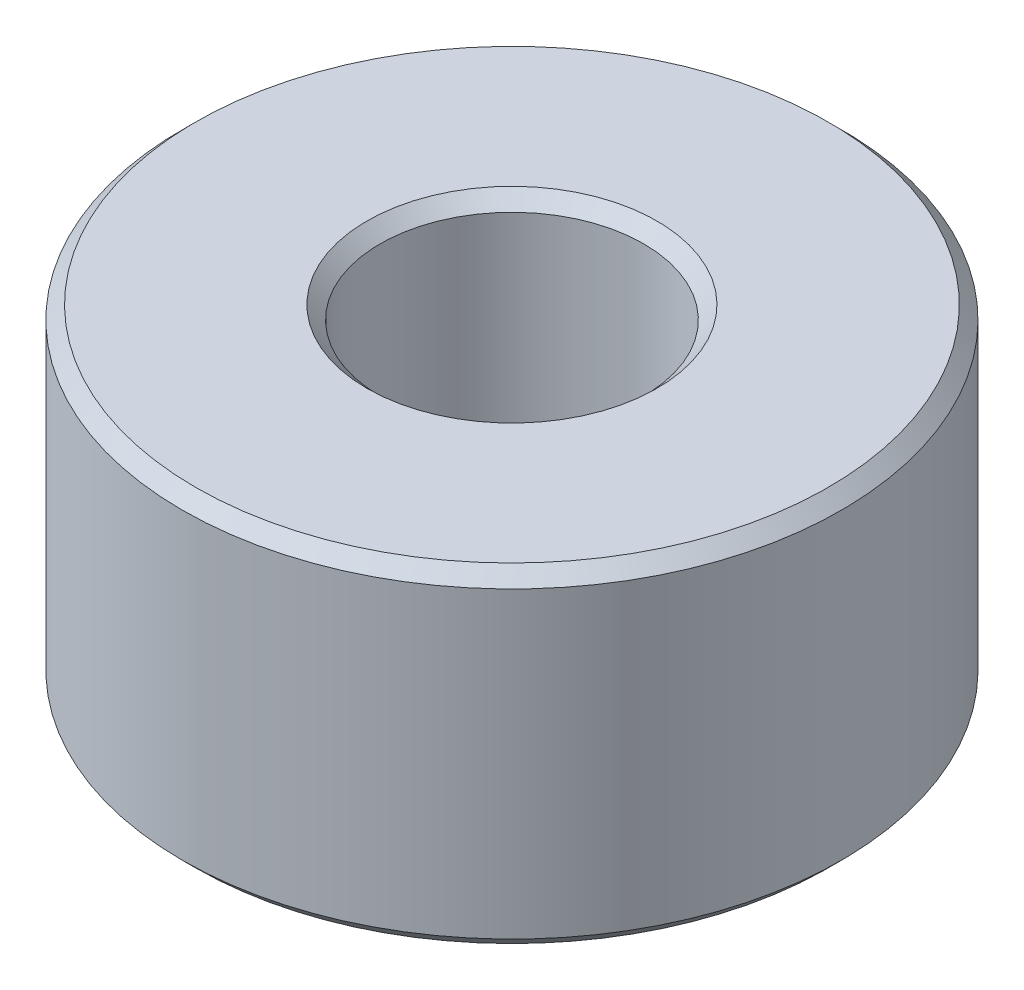
ISO-10303-21;
HEADER;
FILE_DESCRIPTION(('STEP AP214'),'2;1');
FILE_NAME('part.step','',(''),(''),'','','');
FILE_SCHEMA(('AUTOMOTIVE_DESIGN { 1 0 10303 214 1 1 1 1 }'));
ENDSEC;
DATA;
#1=APPLICATION_CONTEXT('core data for automotive mechanical design processes');
#2=APPLICATION_PROTOCOL_DEFINITION('international standard','automotive_design',2000,#1);
#3=PRODUCT_CONTEXT('',#1,'mechanical');
#4=PRODUCT('Part','Part','',(#3));
#5=PRODUCT_RELATED_PRODUCT_CATEGORY('part','',(#4));
#6=PRODUCT_DEFINITION_FORMATION('','',#4);
#7=PRODUCT_DEFINITION_CONTEXT('part definition',#1,'design');
#8=PRODUCT_DEFINITION('design','',#6,#7);
#9=PRODUCT_DEFINITION_SHAPE('','',#8);
#10=(LENGTH_UNIT() NAMED_UNIT(*) SI_UNIT(.MILLI.,.METRE.));
#11=(NAMED_UNIT(*) PLANE_ANGLE_UNIT() SI_UNIT($,.RADIAN.));
#12=(NAMED_UNIT(*) SI_UNIT($,.STERADIAN.) SOLID_ANGLE_UNIT());
#13=UNCERTAINTY_MEASURE_WITH_UNIT(LENGTH_MEASURE(1.E-05),#10,'distance_accuracy_value','');
#14=(GEOMETRIC_REPRESENTATION_CONTEXT(3) GLOBAL_UNCERTAINTY_ASSIGNED_CONTEXT((#13)) GLOBAL_UNIT_ASSIGNED_CONTEXT((#10,
#11,#12)) REPRESENTATION_CONTEXT('',''));
#15=CARTESIAN_POINT('',(0.,0.,0.));
#16=DIRECTION('',(0.,0.,1.));
#17=DIRECTION('',(1.,0.,0.));
#18=AXIS2_PLACEMENT_3D('',#15,#16,#17);
#19=CARTESIAN_POINT('',(0.,2.5,0.));
#20=DIRECTION('',(0.,1.,0.));
#21=DIRECTION('',(0.,0.,1.));
#22=AXIS2_PLACEMENT_3D('',#19,#20,#21);
#23=PLANE('',#22);
#24=CARTESIAN_POINT('',(0.,2.5,0.));
#25=DIRECTION('',(0.,1.,0.));
#26=DIRECTION('',(0.,0.,1.));
#27=AXIS2_PLACEMENT_3D('',#24,#25,#26);
#28=CIRCLE('',#27,2.4);
#29=CARTESIAN_POINT('',(0.,2.5,2.4));
#30=VERTEX_POINT('',#29);
#31=EDGE_CURVE('E10',#30,#30,#28,.T.);
#32=ORIENTED_EDGE('',*,*,#31,.T.);
#33=EDGE_LOOP('',(#32));
#34=FACE_BOUND('',#33,.T.);
#35=CARTESIAN_POINT('',(0.,2.5,0.));
#36=DIRECTION('',(0.,1.,0.));
#37=DIRECTION('',(0.,0.,1.));
#38=AXIS2_PLACEMENT_3D('',#35,#36,#37);
#39=CIRCLE('',#38,1.1);
#40=CARTESIAN_POINT('',(0.,2.5,1.1));
#41=VERTEX_POINT('',#40);
#42=EDGE_CURVE('E39',#41,#41,#39,.F.);
#43=ORIENTED_EDGE('',*,*,#42,.T.);
#44=EDGE_LOOP('',(#43));
#45=FACE_BOUND('',#44,.T.);
#46=ADVANCED_FACE('F32',(#34,#45),#23,.T.);
#47=CARTESIAN_POINT('',(0.,0.,0.));
#48=DIRECTION('',(0.,1.,0.));
#49=DIRECTION('',(0.,0.,1.));
#50=AXIS2_PLACEMENT_3D('',#47,#48,#49);
#51=PLANE('',#50);
#52=CARTESIAN_POINT('',(0.,0.,0.));
#53=DIRECTION('',(0.,1.,0.));
#54=DIRECTION('',(0.,0.,1.));
#55=AXIS2_PLACEMENT_3D('',#52,#53,#54);
#56=CIRCLE('',#55,1.1);
#57=CARTESIAN_POINT('',(0.,0.,1.1));
#58=VERTEX_POINT('',#57);
#59=EDGE_CURVE('E58',#58,#58,#56,.T.);
#60=ORIENTED_EDGE('',*,*,#59,.T.);
#61=EDGE_LOOP('',(#60));
#62=FACE_BOUND('',#61,.T.);
#63=CARTESIAN_POINT('',(0.,0.,0.));
#64=DIRECTION('',(0.,1.,0.));
#65=DIRECTION('',(0.,0.,1.));
#66=AXIS2_PLACEMENT_3D('',#63,#64,#65);
#67=CIRCLE('',#66,2.4);
#68=CARTESIAN_POINT('',(0.,0.,2.4));
#69=VERTEX_POINT('',#68);
#70=EDGE_CURVE('E61',#69,#69,#67,.F.);
#71=ORIENTED_EDGE('',*,*,#70,.T.);
#72=EDGE_LOOP('',(#71));
#73=FACE_BOUND('',#72,.T.);
#74=ADVANCED_FACE('F65',(#62,#73),#51,.F.);
#75=CARTESIAN_POINT('',(0.,2.5,0.));
#76=DIRECTION('',(0.,-1.,0.));
#77=DIRECTION('',(0.,0.,-1.));
#78=AXIS2_PLACEMENT_3D('',#75,#76,#77);
#79=CYLINDRICAL_SURFACE('',#78,2.5);
#80=CARTESIAN_POINT('',(0.,0.099999999999999,0.));
#81=DIRECTION('',(0.,1.,0.));
#82=DIRECTION('',(0.,0.,1.));
#83=AXIS2_PLACEMENT_3D('',#80,#81,#82);
#84=CIRCLE('',#83,2.5);
#85=CARTESIAN_POINT('',(0.,0.099999999999999,2.5));
#86=VERTEX_POINT('',#85);
#87=EDGE_CURVE('E43',#86,#86,#84,.T.);
#88=ORIENTED_EDGE('',*,*,#87,.T.);
#89=EDGE_LOOP('',(#88));
#90=FACE_BOUND('',#89,.T.);
#91=CARTESIAN_POINT('',(0.,2.4,0.));
#92=DIRECTION('',(0.,1.,0.));
#93=DIRECTION('',(0.,0.,1.));
#94=AXIS2_PLACEMENT_3D('',#91,#92,#93);
#95=CIRCLE('',#94,2.5);
#96=CARTESIAN_POINT('',(0.,2.4,2.5));
#97=VERTEX_POINT('',#96);
#98=EDGE_CURVE('E47',#97,#97,#95,.F.);
#99=ORIENTED_EDGE('',*,*,#98,.T.);
#100=EDGE_LOOP('',(#99));
#101=FACE_BOUND('',#100,.T.);
#102=ADVANCED_FACE('F75',(#90,#101),#79,.T.);
#103=CARTESIAN_POINT('',(0.,2.5,0.));
#104=DIRECTION('',(0.,-1.,0.));
#105=DIRECTION('',(0.,0.,-1.));
#106=AXIS2_PLACEMENT_3D('',#103,#104,#105);
#107=CYLINDRICAL_SURFACE('',#106,1.);
#108=CARTESIAN_POINT('',(0.,0.0999999999999994,0.));
#109=DIRECTION('',(0.,1.,0.));
#110=DIRECTION('',(0.,0.,1.));
#111=AXIS2_PLACEMENT_3D('',#108,#109,#110);
#112=CIRCLE('',#111,1.);
#113=CARTESIAN_POINT('',(0.,0.0999999999999994,1.));
#114=VERTEX_POINT('',#113);
#115=EDGE_CURVE('E52',#114,#114,#112,.F.);
#116=ORIENTED_EDGE('',*,*,#115,.T.);
#117=EDGE_LOOP('',(#116));
#118=FACE_BOUND('',#117,.T.);
#119=CARTESIAN_POINT('',(0.,2.4,0.));
#120=DIRECTION('',(0.,1.,0.));
#121=DIRECTION('',(0.,0.,1.));
#122=AXIS2_PLACEMENT_3D('',#119,#120,#121);
#123=CIRCLE('',#122,1.);
#124=CARTESIAN_POINT('',(0.,2.4,1.));
#125=VERTEX_POINT('',#124);
#126=EDGE_CURVE('E55',#125,#125,#123,.T.);
#127=ORIENTED_EDGE('',*,*,#126,.T.);
#128=EDGE_LOOP('',(#127));
#129=FACE_BOUND('',#128,.T.);
#130=ADVANCED_FACE('F78',(#118,#129),#107,.F.);
#131=CARTESIAN_POINT('',(0.,0.,0.));
#132=DIRECTION('',(0.,-1.,0.));
#133=DIRECTION('',(0.,0.,-1.));
#134=AXIS2_PLACEMENT_3D('',#131,#132,#133);
#135=CONICAL_SURFACE('',#134,1.1,0.785398163397448);
#136=ORIENTED_EDGE('',*,*,#115,.F.);
#137=EDGE_LOOP('',(#136));
#138=FACE_BOUND('',#137,.T.);
#139=ORIENTED_EDGE('',*,*,#59,.F.);
#140=EDGE_LOOP('',(#139));
#141=FACE_BOUND('',#140,.T.);
#142=ADVANCED_FACE('F71',(#138,#141),#135,.F.);
#143=CARTESIAN_POINT('',(0.,0.099999999999999,0.));
#144=DIRECTION('',(0.,1.,0.));
#145=DIRECTION('',(0.,0.,1.));
#146=AXIS2_PLACEMENT_3D('',#143,#144,#145);
#147=CONICAL_SURFACE('',#146,2.5,0.78539816339745);
#148=ORIENTED_EDGE('',*,*,#70,.F.);
#149=EDGE_LOOP('',(#148));
#150=FACE_BOUND('',#149,.T.);
#151=ORIENTED_EDGE('',*,*,#87,.F.);
#152=EDGE_LOOP('',(#151));
#153=FACE_BOUND('',#152,.T.);
#154=ADVANCED_FACE('F67',(#150,#153),#147,.T.);
#155=CARTESIAN_POINT('',(0.,2.5,0.));
#156=DIRECTION('',(0.,-1.,0.));
#157=DIRECTION('',(0.,0.,-1.));
#158=AXIS2_PLACEMENT_3D('',#155,#156,#157);
#159=CONICAL_SURFACE('',#158,2.4,0.785398163397446);
#160=ORIENTED_EDGE('',*,*,#98,.F.);
#161=EDGE_LOOP('',(#160));
#162=FACE_BOUND('',#161,.T.);
#163=ORIENTED_EDGE('',*,*,#31,.F.);
#164=EDGE_LOOP('',(#163));
#165=FACE_BOUND('',#164,.T.);
#166=ADVANCED_FACE('F70',(#162,#165),#159,.T.);
#167=CARTESIAN_POINT('',(0.,2.4,0.));
#168=DIRECTION('',(0.,1.,0.));
#169=DIRECTION('',(0.,0.,1.));
#170=AXIS2_PLACEMENT_3D('',#167,#168,#169);
#171=CONICAL_SURFACE('',#170,1.,0.785398163397448);
#172=ORIENTED_EDGE('',*,*,#42,.F.);
#173=EDGE_LOOP('',(#172));
#174=FACE_BOUND('',#173,.T.);
#175=ORIENTED_EDGE('',*,*,#126,.F.);
#176=EDGE_LOOP('',(#175));
#177=FACE_BOUND('',#176,.T.);
#178=ADVANCED_FACE('F34',(#174,#177),#171,.F.);
#179=CLOSED_SHELL('',(#46,#74,#102,#130,#142,#154,#166,#178));
#180=MANIFOLD_SOLID_BREP('B2',#179);
#181=ADVANCED_BREP_SHAPE_REPRESENTATION('',(#18,#180),#14);
#182=SHAPE_DEFINITION_REPRESENTATION(#9,#181);
ENDSEC;
END-ISO-10303-21;
